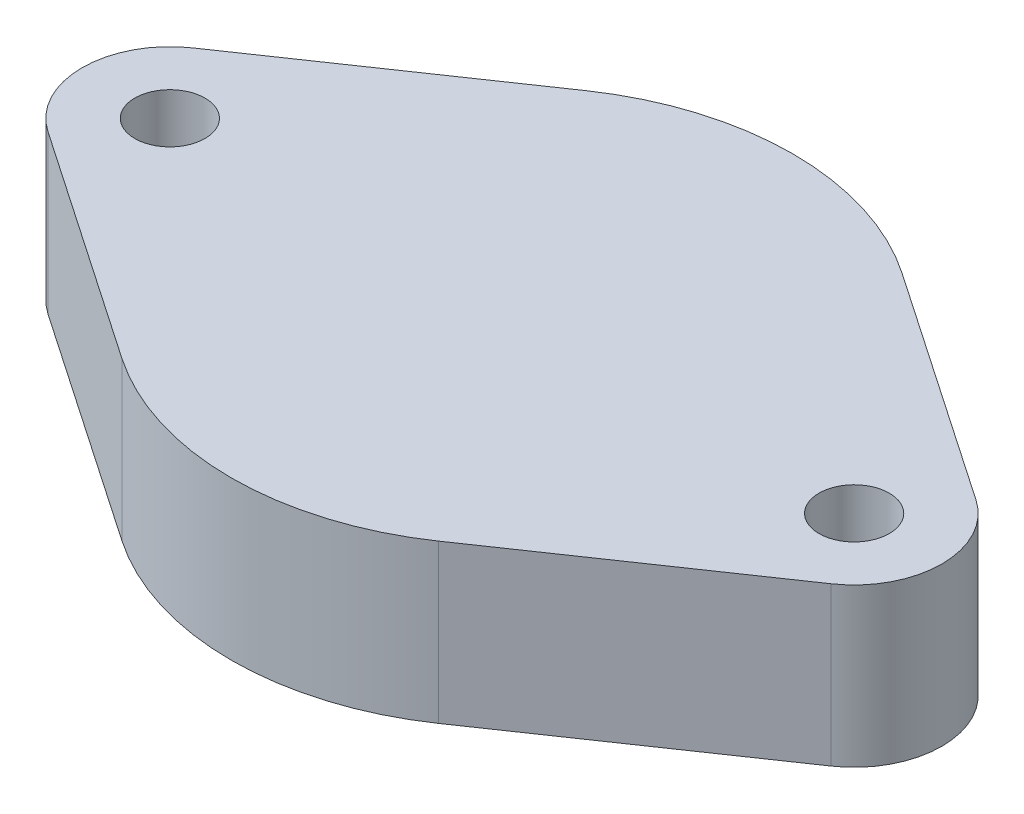
ISO-10303-21;
HEADER;
FILE_DESCRIPTION(('STEP AP214'),'2;1');
FILE_NAME('part.step','',(''),(''),'','','');
FILE_SCHEMA(('AUTOMOTIVE_DESIGN { 1 0 10303 214 1 1 1 1 }'));
ENDSEC;
DATA;
#1=APPLICATION_CONTEXT('core data for automotive mechanical design processes');
#2=APPLICATION_PROTOCOL_DEFINITION('international standard','automotive_design',2000,#1);
#3=PRODUCT_CONTEXT('',#1,'mechanical');
#4=PRODUCT('Part','Part','',(#3));
#5=PRODUCT_RELATED_PRODUCT_CATEGORY('part','',(#4));
#6=PRODUCT_DEFINITION_FORMATION('','',#4);
#7=PRODUCT_DEFINITION_CONTEXT('part definition',#1,'design');
#8=PRODUCT_DEFINITION('design','',#6,#7);
#9=PRODUCT_DEFINITION_SHAPE('','',#8);
#10=(LENGTH_UNIT() NAMED_UNIT(*) SI_UNIT(.MILLI.,.METRE.));
#11=(NAMED_UNIT(*) PLANE_ANGLE_UNIT() SI_UNIT($,.RADIAN.));
#12=(NAMED_UNIT(*) SI_UNIT($,.STERADIAN.) SOLID_ANGLE_UNIT());
#13=UNCERTAINTY_MEASURE_WITH_UNIT(LENGTH_MEASURE(1.E-05),#10,'distance_accuracy_value','');
#14=(GEOMETRIC_REPRESENTATION_CONTEXT(3) GLOBAL_UNCERTAINTY_ASSIGNED_CONTEXT((#13)) GLOBAL_UNIT_ASSIGNED_CONTEXT((#10,
#11,#12)) REPRESENTATION_CONTEXT('',''));
#15=CARTESIAN_POINT('',(0.,0.,0.));
#16=DIRECTION('',(0.,0.,1.));
#17=DIRECTION('',(1.,0.,0.));
#18=AXIS2_PLACEMENT_3D('',#15,#16,#17);
#19=CARTESIAN_POINT('',(-19.5,9.,0.));
#20=DIRECTION('',(0.,-1.,0.));
#21=DIRECTION('',(0.,0.,-1.));
#22=AXIS2_PLACEMENT_3D('',#19,#20,#21);
#23=PLANE('',#22);
#24=CARTESIAN_POINT('',(-19.5,9.,0.));
#25=DIRECTION('',(0.,1.,0.));
#26=DIRECTION('',(0.,0.,-1.));
#27=AXIS2_PLACEMENT_3D('',#24,#25,#26);
#28=CIRCLE('',#27,5.);
#29=CARTESIAN_POINT('',(-22.3205128205128,9.,-4.12852363797554));
#30=VERTEX_POINT('',#29);
#31=CARTESIAN_POINT('',(-22.3205128205128,9.,4.12852363797554));
#32=VERTEX_POINT('',#31);
#33=EDGE_CURVE('E145',#30,#32,#28,.T.);
#34=ORIENTED_EDGE('',*,*,#33,.T.);
#35=DIRECTION('',(0.825704727595109,0.,0.564102564102564));
#36=VECTOR('',#35,1.);
#37=CARTESIAN_POINT('',(-9.02564102564103,9.,13.2112756415217));
#38=LINE('',#37,#36);
#39=CARTESIAN_POINT('',(-9.02564102564102,9.,13.2112756415217));
#40=VERTEX_POINT('',#39);
#41=EDGE_CURVE('E93',#32,#40,#38,.T.);
#42=ORIENTED_EDGE('',*,*,#41,.T.);
#43=CARTESIAN_POINT('',(0.,9.,0.));
#44=DIRECTION('',(0.,1.,0.));
#45=DIRECTION('',(0.,0.,-1.));
#46=AXIS2_PLACEMENT_3D('',#43,#44,#45);
#47=CIRCLE('',#46,16.);
#48=CARTESIAN_POINT('',(9.02564102564103,9.,13.2112756415217));
#49=VERTEX_POINT('',#48);
#50=EDGE_CURVE('E160',#40,#49,#47,.T.);
#51=ORIENTED_EDGE('',*,*,#50,.T.);
#52=DIRECTION('',(0.825704727595109,0.,-0.564102564102564));
#53=VECTOR('',#52,1.);
#54=CARTESIAN_POINT('',(22.3205128205128,9.,4.12852363797554));
#55=LINE('',#54,#53);
#56=CARTESIAN_POINT('',(22.3205128205128,9.,4.12852363797554));
#57=VERTEX_POINT('',#56);
#58=EDGE_CURVE('E173',#49,#57,#55,.T.);
#59=ORIENTED_EDGE('',*,*,#58,.T.);
#60=CARTESIAN_POINT('',(19.5,9.,0.));
#61=DIRECTION('',(0.,1.,0.));
#62=DIRECTION('',(0.,0.,-1.));
#63=AXIS2_PLACEMENT_3D('',#60,#61,#62);
#64=CIRCLE('',#63,5.);
#65=CARTESIAN_POINT('',(22.3205128205128,9.,-4.12852363797554));
#66=VERTEX_POINT('',#65);
#67=EDGE_CURVE('E112',#57,#66,#64,.T.);
#68=ORIENTED_EDGE('',*,*,#67,.T.);
#69=DIRECTION('',(-0.825704727595109,0.,-0.564102564102564));
#70=VECTOR('',#69,1.);
#71=CARTESIAN_POINT('',(9.02564102564103,9.,-13.2112756415217));
#72=LINE('',#71,#70);
#73=CARTESIAN_POINT('',(9.02564102564102,9.,-13.2112756415217));
#74=VERTEX_POINT('',#73);
#75=EDGE_CURVE('E106',#66,#74,#72,.T.);
#76=ORIENTED_EDGE('',*,*,#75,.T.);
#77=CARTESIAN_POINT('',(0.,9.,0.));
#78=DIRECTION('',(0.,1.,0.));
#79=DIRECTION('',(0.,0.,-1.));
#80=AXIS2_PLACEMENT_3D('',#77,#78,#79);
#81=CIRCLE('',#80,16.);
#82=CARTESIAN_POINT('',(-9.02564102564103,9.,-13.2112756415217));
#83=VERTEX_POINT('',#82);
#84=EDGE_CURVE('E110',#74,#83,#81,.T.);
#85=ORIENTED_EDGE('',*,*,#84,.T.);
#86=DIRECTION('',(-0.825704727595109,0.,0.564102564102564));
#87=VECTOR('',#86,1.);
#88=CARTESIAN_POINT('',(-22.3205128205128,9.,-4.12852363797554));
#89=LINE('',#88,#87);
#90=EDGE_CURVE('E50',#83,#30,#89,.T.);
#91=ORIENTED_EDGE('',*,*,#90,.T.);
#92=EDGE_LOOP('',(#34,#42,#51,#59,#68,#76,#85,#91));
#93=FACE_BOUND('',#92,.T.);
#94=CARTESIAN_POINT('',(19.5,9.,0.));
#95=DIRECTION('',(0.,1.,0.));
#96=DIRECTION('',(0.,0.,1.));
#97=AXIS2_PLACEMENT_3D('',#94,#95,#96);
#98=CIRCLE('',#97,2.);
#99=CARTESIAN_POINT('',(19.5,9.,2.));
#100=VERTEX_POINT('',#99);
#101=EDGE_CURVE('E134',#100,#100,#98,.T.);
#102=ORIENTED_EDGE('',*,*,#101,.F.);
#103=EDGE_LOOP('',(#102));
#104=FACE_BOUND('',#103,.T.);
#105=CARTESIAN_POINT('',(-19.5,9.,0.));
#106=DIRECTION('',(0.,1.,0.));
#107=DIRECTION('',(0.,0.,1.));
#108=AXIS2_PLACEMENT_3D('',#105,#106,#107);
#109=CIRCLE('',#108,2.);
#110=CARTESIAN_POINT('',(-19.5,9.,2.));
#111=VERTEX_POINT('',#110);
#112=EDGE_CURVE('E182',#111,#111,#109,.T.);
#113=ORIENTED_EDGE('',*,*,#112,.F.);
#114=EDGE_LOOP('',(#113));
#115=FACE_BOUND('',#114,.T.);
#116=ADVANCED_FACE('F33',(#93,#104,#115),#23,.F.);
#117=CARTESIAN_POINT('',(-19.5,0.,0.));
#118=DIRECTION('',(0.,-1.,0.));
#119=DIRECTION('',(0.,0.,-1.));
#120=AXIS2_PLACEMENT_3D('',#117,#118,#119);
#121=PLANE('',#120);
#122=CARTESIAN_POINT('',(19.5,0.,0.));
#123=DIRECTION('',(0.,1.,0.));
#124=DIRECTION('',(0.,0.,1.));
#125=AXIS2_PLACEMENT_3D('',#122,#123,#124);
#126=CIRCLE('',#125,2.);
#127=CARTESIAN_POINT('',(19.5,0.,2.));
#128=VERTEX_POINT('',#127);
#129=EDGE_CURVE('E179',#128,#128,#126,.T.);
#130=ORIENTED_EDGE('',*,*,#129,.T.);
#131=EDGE_LOOP('',(#130));
#132=FACE_BOUND('',#131,.T.);
#133=CARTESIAN_POINT('',(-19.5,0.,0.));
#134=DIRECTION('',(0.,1.,0.));
#135=DIRECTION('',(0.,0.,-1.));
#136=AXIS2_PLACEMENT_3D('',#133,#134,#135);
#137=CIRCLE('',#136,5.);
#138=CARTESIAN_POINT('',(-22.3205128205128,0.,-4.12852363797554));
#139=VERTEX_POINT('',#138);
#140=CARTESIAN_POINT('',(-22.3205128205128,0.,4.12852363797554));
#141=VERTEX_POINT('',#140);
#142=EDGE_CURVE('E130',#139,#141,#137,.T.);
#143=ORIENTED_EDGE('',*,*,#142,.F.);
#144=DIRECTION('',(-0.825704727595109,0.,0.564102564102564));
#145=VECTOR('',#144,1.);
#146=CARTESIAN_POINT('',(-22.3205128205128,0.,-4.12852363797554));
#147=LINE('',#146,#145);
#148=CARTESIAN_POINT('',(-9.02564102564103,0.,-13.2112756415217));
#149=VERTEX_POINT('',#148);
#150=EDGE_CURVE('E85',#149,#139,#147,.T.);
#151=ORIENTED_EDGE('',*,*,#150,.F.);
#152=CARTESIAN_POINT('',(0.,0.,0.));
#153=DIRECTION('',(0.,1.,0.));
#154=DIRECTION('',(0.,0.,-1.));
#155=AXIS2_PLACEMENT_3D('',#152,#153,#154);
#156=CIRCLE('',#155,16.);
#157=CARTESIAN_POINT('',(9.02564102564102,0.,-13.2112756415217));
#158=VERTEX_POINT('',#157);
#159=EDGE_CURVE('E79',#158,#149,#156,.T.);
#160=ORIENTED_EDGE('',*,*,#159,.F.);
#161=DIRECTION('',(-0.825704727595109,0.,-0.564102564102564));
#162=VECTOR('',#161,1.);
#163=CARTESIAN_POINT('',(9.02564102564103,0.,-13.2112756415217));
#164=LINE('',#163,#162);
#165=CARTESIAN_POINT('',(22.3205128205128,0.,-4.12852363797554));
#166=VERTEX_POINT('',#165);
#167=EDGE_CURVE('E120',#166,#158,#164,.T.);
#168=ORIENTED_EDGE('',*,*,#167,.F.);
#169=CARTESIAN_POINT('',(19.5,0.,0.));
#170=DIRECTION('',(0.,1.,0.));
#171=DIRECTION('',(0.,0.,-1.));
#172=AXIS2_PLACEMENT_3D('',#169,#170,#171);
#173=CIRCLE('',#172,5.);
#174=CARTESIAN_POINT('',(22.3205128205128,0.,4.12852363797554));
#175=VERTEX_POINT('',#174);
#176=EDGE_CURVE('E140',#175,#166,#173,.T.);
#177=ORIENTED_EDGE('',*,*,#176,.F.);
#178=DIRECTION('',(0.825704727595109,0.,-0.564102564102564));
#179=VECTOR('',#178,1.);
#180=CARTESIAN_POINT('',(22.3205128205128,0.,4.12852363797554));
#181=LINE('',#180,#179);
#182=CARTESIAN_POINT('',(9.02564102564103,0.,13.2112756415217));
#183=VERTEX_POINT('',#182);
#184=EDGE_CURVE('E138',#183,#175,#181,.T.);
#185=ORIENTED_EDGE('',*,*,#184,.F.);
#186=CARTESIAN_POINT('',(0.,0.,0.));
#187=DIRECTION('',(0.,1.,0.));
#188=DIRECTION('',(0.,0.,-1.));
#189=AXIS2_PLACEMENT_3D('',#186,#187,#188);
#190=CIRCLE('',#189,16.);
#191=CARTESIAN_POINT('',(-9.02564102564102,0.,13.2112756415217));
#192=VERTEX_POINT('',#191);
#193=EDGE_CURVE('E136',#192,#183,#190,.T.);
#194=ORIENTED_EDGE('',*,*,#193,.F.);
#195=DIRECTION('',(0.825704727595109,0.,0.564102564102564));
#196=VECTOR('',#195,1.);
#197=CARTESIAN_POINT('',(-9.02564102564103,0.,13.2112756415217));
#198=LINE('',#197,#196);
#199=EDGE_CURVE('E133',#141,#192,#198,.T.);
#200=ORIENTED_EDGE('',*,*,#199,.F.);
#201=EDGE_LOOP('',(#143,#151,#160,#168,#177,#185,#194,#200));
#202=FACE_BOUND('',#201,.T.);
#203=CARTESIAN_POINT('',(-19.5,0.,0.));
#204=DIRECTION('',(0.,1.,0.));
#205=DIRECTION('',(0.,0.,1.));
#206=AXIS2_PLACEMENT_3D('',#203,#204,#205);
#207=CIRCLE('',#206,2.);
#208=CARTESIAN_POINT('',(-19.5,0.,2.));
#209=VERTEX_POINT('',#208);
#210=EDGE_CURVE('E185',#209,#209,#207,.T.);
#211=ORIENTED_EDGE('',*,*,#210,.T.);
#212=EDGE_LOOP('',(#211));
#213=FACE_BOUND('',#212,.T.);
#214=ADVANCED_FACE('F164',(#132,#202,#213),#121,.T.);
#215=CARTESIAN_POINT('',(-19.5,9.,0.));
#216=DIRECTION('',(0.,-1.,0.));
#217=DIRECTION('',(0.,0.,-1.));
#218=AXIS2_PLACEMENT_3D('',#215,#216,#217);
#219=CYLINDRICAL_SURFACE('',#218,5.);
#220=ORIENTED_EDGE('',*,*,#142,.T.);
#221=DIRECTION('',(0.,-1.,0.));
#222=VECTOR('',#221,1.);
#223=CARTESIAN_POINT('',(-22.3205128205128,9.,4.12852363797554));
#224=LINE('',#223,#222);
#225=EDGE_CURVE('E11',#32,#141,#224,.T.);
#226=ORIENTED_EDGE('',*,*,#225,.F.);
#227=ORIENTED_EDGE('',*,*,#33,.F.);
#228=DIRECTION('',(0.,-1.,0.));
#229=VECTOR('',#228,1.);
#230=CARTESIAN_POINT('',(-22.3205128205128,9.,-4.12852363797554));
#231=LINE('',#230,#229);
#232=EDGE_CURVE('E126',#30,#139,#231,.T.);
#233=ORIENTED_EDGE('',*,*,#232,.T.);
#234=EDGE_LOOP('',(#220,#226,#227,#233));
#235=FACE_BOUND('',#234,.T.);
#236=ADVANCED_FACE('F35',(#235),#219,.T.);
#237=CARTESIAN_POINT('',(-9.02564102564103,9.,13.2112756415217));
#238=DIRECTION('',(0.564102564102564,0.,-0.825704727595108));
#239=DIRECTION('',(-0.825704727595109,0.,-0.564102564102564));
#240=AXIS2_PLACEMENT_3D('',#237,#238,#239);
#241=PLANE('',#240);
#242=ORIENTED_EDGE('',*,*,#199,.T.);
#243=DIRECTION('',(0.,-1.,0.));
#244=VECTOR('',#243,1.);
#245=CARTESIAN_POINT('',(-9.02564102564102,9.,13.2112756415217));
#246=LINE('',#245,#244);
#247=EDGE_CURVE('E42',#40,#192,#246,.T.);
#248=ORIENTED_EDGE('',*,*,#247,.F.);
#249=ORIENTED_EDGE('',*,*,#41,.F.);
#250=ORIENTED_EDGE('',*,*,#225,.T.);
#251=EDGE_LOOP('',(#242,#248,#249,#250));
#252=FACE_BOUND('',#251,.T.);
#253=ADVANCED_FACE('F217',(#252),#241,.F.);
#254=CARTESIAN_POINT('',(0.,9.,0.));
#255=DIRECTION('',(0.,-1.,0.));
#256=DIRECTION('',(0.,0.,-1.));
#257=AXIS2_PLACEMENT_3D('',#254,#255,#256);
#258=CYLINDRICAL_SURFACE('',#257,16.);
#259=ORIENTED_EDGE('',*,*,#193,.T.);
#260=DIRECTION('',(0.,-1.,0.));
#261=VECTOR('',#260,1.);
#262=CARTESIAN_POINT('',(9.02564102564103,9.,13.2112756415217));
#263=LINE('',#262,#261);
#264=EDGE_CURVE('E152',#49,#183,#263,.T.);
#265=ORIENTED_EDGE('',*,*,#264,.F.);
#266=ORIENTED_EDGE('',*,*,#50,.F.);
#267=ORIENTED_EDGE('',*,*,#247,.T.);
#268=EDGE_LOOP('',(#259,#265,#266,#267));
#269=FACE_BOUND('',#268,.T.);
#270=ADVANCED_FACE('F158',(#269),#258,.T.);
#271=CARTESIAN_POINT('',(22.3205128205128,9.,4.12852363797554));
#272=DIRECTION('',(-0.564102564102564,0.,-0.825704727595109));
#273=DIRECTION('',(-0.825704727595109,0.,0.564102564102564));
#274=AXIS2_PLACEMENT_3D('',#271,#272,#273);
#275=PLANE('',#274);
#276=ORIENTED_EDGE('',*,*,#184,.T.);
#277=DIRECTION('',(0.,-1.,0.));
#278=VECTOR('',#277,1.);
#279=CARTESIAN_POINT('',(22.3205128205128,9.,4.12852363797554));
#280=LINE('',#279,#278);
#281=EDGE_CURVE('E149',#57,#175,#280,.T.);
#282=ORIENTED_EDGE('',*,*,#281,.F.);
#283=ORIENTED_EDGE('',*,*,#58,.F.);
#284=ORIENTED_EDGE('',*,*,#264,.T.);
#285=EDGE_LOOP('',(#276,#282,#283,#284));
#286=FACE_BOUND('',#285,.T.);
#287=ADVANCED_FACE('F169',(#286),#275,.F.);
#288=CARTESIAN_POINT('',(19.5,9.,0.));
#289=DIRECTION('',(0.,-1.,0.));
#290=DIRECTION('',(0.,0.,-1.));
#291=AXIS2_PLACEMENT_3D('',#288,#289,#290);
#292=CYLINDRICAL_SURFACE('',#291,5.);
#293=ORIENTED_EDGE('',*,*,#176,.T.);
#294=DIRECTION('',(0.,-1.,0.));
#295=VECTOR('',#294,1.);
#296=CARTESIAN_POINT('',(22.3205128205128,9.,-4.12852363797554));
#297=LINE('',#296,#295);
#298=EDGE_CURVE('E121',#66,#166,#297,.T.);
#299=ORIENTED_EDGE('',*,*,#298,.F.);
#300=ORIENTED_EDGE('',*,*,#67,.F.);
#301=ORIENTED_EDGE('',*,*,#281,.T.);
#302=EDGE_LOOP('',(#293,#299,#300,#301));
#303=FACE_BOUND('',#302,.T.);
#304=ADVANCED_FACE('F172',(#303),#292,.T.);
#305=CARTESIAN_POINT('',(9.02564102564103,9.,-13.2112756415217));
#306=DIRECTION('',(-0.564102564102564,0.,0.825704727595109));
#307=DIRECTION('',(0.825704727595109,0.,0.564102564102564));
#308=AXIS2_PLACEMENT_3D('',#305,#306,#307);
#309=PLANE('',#308);
#310=ORIENTED_EDGE('',*,*,#167,.T.);
#311=DIRECTION('',(0.,-1.,0.));
#312=VECTOR('',#311,1.);
#313=CARTESIAN_POINT('',(9.02564102564102,9.,-13.2112756415217));
#314=LINE('',#313,#312);
#315=EDGE_CURVE('E117',#74,#158,#314,.T.);
#316=ORIENTED_EDGE('',*,*,#315,.F.);
#317=ORIENTED_EDGE('',*,*,#75,.F.);
#318=ORIENTED_EDGE('',*,*,#298,.T.);
#319=EDGE_LOOP('',(#310,#316,#317,#318));
#320=FACE_BOUND('',#319,.T.);
#321=ADVANCED_FACE('F118',(#320),#309,.F.);
#322=CARTESIAN_POINT('',(0.,9.,0.));
#323=DIRECTION('',(0.,-1.,0.));
#324=DIRECTION('',(0.,0.,-1.));
#325=AXIS2_PLACEMENT_3D('',#322,#323,#324);
#326=CYLINDRICAL_SURFACE('',#325,16.);
#327=ORIENTED_EDGE('',*,*,#159,.T.);
#328=DIRECTION('',(0.,-1.,0.));
#329=VECTOR('',#328,1.);
#330=CARTESIAN_POINT('',(-9.02564102564103,9.,-13.2112756415217));
#331=LINE('',#330,#329);
#332=EDGE_CURVE('E122',#83,#149,#331,.T.);
#333=ORIENTED_EDGE('',*,*,#332,.F.);
#334=ORIENTED_EDGE('',*,*,#84,.F.);
#335=ORIENTED_EDGE('',*,*,#315,.T.);
#336=EDGE_LOOP('',(#327,#333,#334,#335));
#337=FACE_BOUND('',#336,.T.);
#338=ADVANCED_FACE('F124',(#337),#326,.T.);
#339=CARTESIAN_POINT('',(-22.3205128205128,9.,-4.12852363797554));
#340=DIRECTION('',(0.564102564102564,0.,0.825704727595108));
#341=DIRECTION('',(0.825704727595109,0.,-0.564102564102564));
#342=AXIS2_PLACEMENT_3D('',#339,#340,#341);
#343=PLANE('',#342);
#344=ORIENTED_EDGE('',*,*,#150,.T.);
#345=ORIENTED_EDGE('',*,*,#232,.F.);
#346=ORIENTED_EDGE('',*,*,#90,.F.);
#347=ORIENTED_EDGE('',*,*,#332,.T.);
#348=EDGE_LOOP('',(#344,#345,#346,#347));
#349=FACE_BOUND('',#348,.T.);
#350=ADVANCED_FACE('F205',(#349),#343,.F.);
#351=CARTESIAN_POINT('',(19.5,9.,0.));
#352=DIRECTION('',(0.,-1.,0.));
#353=DIRECTION('',(0.,0.,-1.));
#354=AXIS2_PLACEMENT_3D('',#351,#352,#353);
#355=CYLINDRICAL_SURFACE('',#354,2.);
#356=ORIENTED_EDGE('',*,*,#101,.T.);
#357=EDGE_LOOP('',(#356));
#358=FACE_BOUND('',#357,.T.);
#359=ORIENTED_EDGE('',*,*,#129,.F.);
#360=EDGE_LOOP('',(#359));
#361=FACE_BOUND('',#360,.T.);
#362=ADVANCED_FACE('F202',(#358,#361),#355,.F.);
#363=CARTESIAN_POINT('',(-19.5,9.,0.));
#364=DIRECTION('',(0.,-1.,0.));
#365=DIRECTION('',(0.,0.,-1.));
#366=AXIS2_PLACEMENT_3D('',#363,#364,#365);
#367=CYLINDRICAL_SURFACE('',#366,2.);
#368=ORIENTED_EDGE('',*,*,#112,.T.);
#369=EDGE_LOOP('',(#368));
#370=FACE_BOUND('',#369,.T.);
#371=ORIENTED_EDGE('',*,*,#210,.F.);
#372=EDGE_LOOP('',(#371));
#373=FACE_BOUND('',#372,.T.);
#374=ADVANCED_FACE('F191',(#370,#373),#367,.F.);
#375=CLOSED_SHELL('',(#116,#214,#236,#253,#270,#287,#304,#321,#338,#350,#362,#374));
#376=MANIFOLD_SOLID_BREP('B2',#375);
#377=ADVANCED_BREP_SHAPE_REPRESENTATION('',(#18,#376),#14);
#378=SHAPE_DEFINITION_REPRESENTATION(#9,#377);
ENDSEC;
END-ISO-10303-21;
